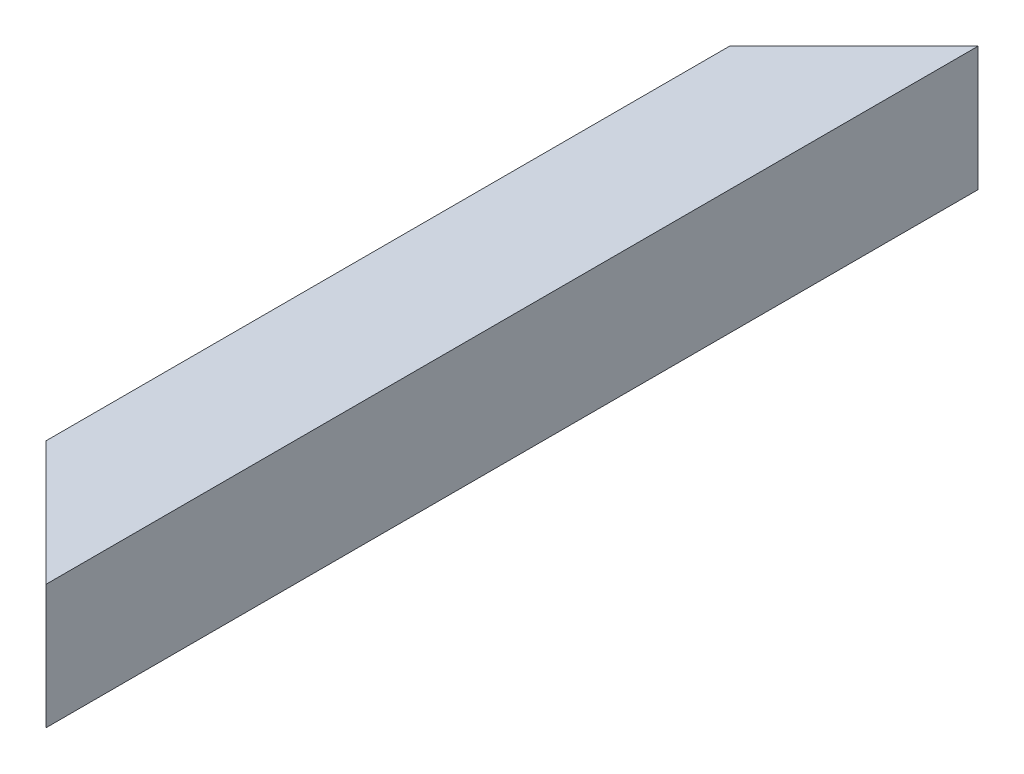
ISO-10303-21;
HEADER;
FILE_DESCRIPTION(('STEP AP214'),'2;1');
FILE_NAME('part.step','',(''),(''),'','','');
FILE_SCHEMA(('AUTOMOTIVE_DESIGN { 1 0 10303 214 1 1 1 1 }'));
ENDSEC;
DATA;
#1=APPLICATION_CONTEXT('core data for automotive mechanical design processes');
#2=APPLICATION_PROTOCOL_DEFINITION('international standard','automotive_design',2000,#1);
#3=PRODUCT_CONTEXT('',#1,'mechanical');
#4=PRODUCT('Part','Part','',(#3));
#5=PRODUCT_RELATED_PRODUCT_CATEGORY('part','',(#4));
#6=PRODUCT_DEFINITION_FORMATION('','',#4);
#7=PRODUCT_DEFINITION_CONTEXT('part definition',#1,'design');
#8=PRODUCT_DEFINITION('design','',#6,#7);
#9=PRODUCT_DEFINITION_SHAPE('','',#8);
#10=(LENGTH_UNIT() NAMED_UNIT(*) SI_UNIT(.MILLI.,.METRE.));
#11=(NAMED_UNIT(*) PLANE_ANGLE_UNIT() SI_UNIT($,.RADIAN.));
#12=(NAMED_UNIT(*) SI_UNIT($,.STERADIAN.) SOLID_ANGLE_UNIT());
#13=UNCERTAINTY_MEASURE_WITH_UNIT(LENGTH_MEASURE(1.E-05),#10,'distance_accuracy_value','');
#14=(GEOMETRIC_REPRESENTATION_CONTEXT(3) GLOBAL_UNCERTAINTY_ASSIGNED_CONTEXT((#13)) GLOBAL_UNIT_ASSIGNED_CONTEXT((#10,
#11,#12)) REPRESENTATION_CONTEXT('',''));
#15=CARTESIAN_POINT('',(0.,0.,0.));
#16=DIRECTION('',(0.,0.,1.));
#17=DIRECTION('',(1.,0.,0.));
#18=AXIS2_PLACEMENT_3D('',#15,#16,#17);
#19=CARTESIAN_POINT('',(-16.,16.,0.));
#20=DIRECTION('',(1.,0.,0.));
#21=DIRECTION('',(0.,0.,-1.));
#22=AXIS2_PLACEMENT_3D('',#19,#20,#21);
#23=PLANE('',#22);
#24=DIRECTION('',(0.,-1.,0.));
#25=VECTOR('',#24,1.);
#26=CARTESIAN_POINT('',(-16.,16.,35.9999999999996));
#27=LINE('',#26,#25);
#28=CARTESIAN_POINT('',(-16.,16.,35.9999999999996));
#29=VERTEX_POINT('',#28);
#30=CARTESIAN_POINT('',(-16.,-16.,35.9999999999996));
#31=VERTEX_POINT('',#30);
#32=EDGE_CURVE('E11',#29,#31,#27,.T.);
#33=ORIENTED_EDGE('',*,*,#32,.F.);
#34=DIRECTION('',(0.,0.,1.));
#35=VECTOR('',#34,1.);
#36=CARTESIAN_POINT('',(-16.,16.,0.));
#37=LINE('',#36,#35);
#38=CARTESIAN_POINT('',(-16.,16.,264.000000000001));
#39=VERTEX_POINT('',#38);
#40=EDGE_CURVE('E146',#29,#39,#37,.T.);
#41=ORIENTED_EDGE('',*,*,#40,.T.);
#42=DIRECTION('',(0.,1.,0.));
#43=VECTOR('',#42,1.);
#44=CARTESIAN_POINT('',(-16.,16.,264.000000000001));
#45=LINE('',#44,#43);
#46=CARTESIAN_POINT('',(-16.,-16.,264.000000000001));
#47=VERTEX_POINT('',#46);
#48=EDGE_CURVE('E44',#47,#39,#45,.T.);
#49=ORIENTED_EDGE('',*,*,#48,.F.);
#50=DIRECTION('',(0.,0.,1.));
#51=VECTOR('',#50,1.);
#52=CARTESIAN_POINT('',(-16.,-16.,0.));
#53=LINE('',#52,#51);
#54=EDGE_CURVE('E133',#31,#47,#53,.T.);
#55=ORIENTED_EDGE('',*,*,#54,.F.);
#56=EDGE_LOOP('',(#33,#41,#49,#55));
#57=FACE_BOUND('',#56,.T.);
#58=ADVANCED_FACE('F36',(#57),#23,.T.);
#59=CARTESIAN_POINT('',(-16.,-16.,0.));
#60=DIRECTION('',(0.,1.,0.));
#61=DIRECTION('',(0.,0.,1.));
#62=AXIS2_PLACEMENT_3D('',#59,#60,#61);
#63=PLANE('',#62);
#64=DIRECTION('',(0.707106781186551,0.,-0.707106781186544));
#65=VECTOR('',#64,1.);
#66=CARTESIAN_POINT('',(1.99999999999982,-16.,18.));
#67=LINE('',#66,#65);
#68=CARTESIAN_POINT('',(16.,-16.,3.99999999999997));
#69=VERTEX_POINT('',#68);
#70=EDGE_CURVE('E166',#31,#69,#67,.T.);
#71=ORIENTED_EDGE('',*,*,#70,.F.);
#72=ORIENTED_EDGE('',*,*,#54,.T.);
#73=DIRECTION('',(-0.707106781186552,0.,-0.707106781186543));
#74=VECTOR('',#73,1.);
#75=CARTESIAN_POINT('',(-148.,-16.,132.000000000002));
#76=LINE('',#75,#74);
#77=CARTESIAN_POINT('',(16.,-16.,296.));
#78=VERTEX_POINT('',#77);
#79=EDGE_CURVE('E58',#78,#47,#76,.T.);
#80=ORIENTED_EDGE('',*,*,#79,.F.);
#81=DIRECTION('',(0.,0.,1.));
#82=VECTOR('',#81,1.);
#83=CARTESIAN_POINT('',(16.,-16.,0.));
#84=LINE('',#83,#82);
#85=EDGE_CURVE('E136',#69,#78,#84,.T.);
#86=ORIENTED_EDGE('',*,*,#85,.F.);
#87=EDGE_LOOP('',(#71,#72,#80,#86));
#88=FACE_BOUND('',#87,.T.);
#89=ADVANCED_FACE('F182',(#88),#63,.T.);
#90=CARTESIAN_POINT('',(16.,16.,0.));
#91=DIRECTION('',(-1.,0.,0.));
#92=DIRECTION('',(0.,0.,1.));
#93=AXIS2_PLACEMENT_3D('',#90,#91,#92);
#94=PLANE('',#93);
#95=DIRECTION('',(0.,1.,0.));
#96=VECTOR('',#95,1.);
#97=CARTESIAN_POINT('',(16.,16.,3.99999999999997));
#98=LINE('',#97,#96);
#99=CARTESIAN_POINT('',(16.,16.,3.99999999999997));
#100=VERTEX_POINT('',#99);
#101=EDGE_CURVE('E168',#69,#100,#98,.T.);
#102=ORIENTED_EDGE('',*,*,#101,.F.);
#103=ORIENTED_EDGE('',*,*,#85,.T.);
#104=DIRECTION('',(0.,-1.,0.));
#105=VECTOR('',#104,1.);
#106=CARTESIAN_POINT('',(16.,16.,296.));
#107=LINE('',#106,#105);
#108=CARTESIAN_POINT('',(16.,16.,296.));
#109=VERTEX_POINT('',#108);
#110=EDGE_CURVE('E162',#109,#78,#107,.T.);
#111=ORIENTED_EDGE('',*,*,#110,.F.);
#112=DIRECTION('',(0.,0.,1.));
#113=VECTOR('',#112,1.);
#114=CARTESIAN_POINT('',(16.,16.,0.));
#115=LINE('',#114,#113);
#116=EDGE_CURVE('E142',#100,#109,#115,.T.);
#117=ORIENTED_EDGE('',*,*,#116,.F.);
#118=EDGE_LOOP('',(#102,#103,#111,#117));
#119=FACE_BOUND('',#118,.T.);
#120=ADVANCED_FACE('F179',(#119),#94,.T.);
#121=CARTESIAN_POINT('',(-16.,16.,0.));
#122=DIRECTION('',(0.,-1.,0.));
#123=DIRECTION('',(0.,0.,-1.));
#124=AXIS2_PLACEMENT_3D('',#121,#122,#123);
#125=PLANE('',#124);
#126=DIRECTION('',(-0.707106781186551,0.,0.707106781186544));
#127=VECTOR('',#126,1.);
#128=CARTESIAN_POINT('',(1.99999999999982,16.,18.));
#129=LINE('',#128,#127);
#130=EDGE_CURVE('E50',#100,#29,#129,.T.);
#131=ORIENTED_EDGE('',*,*,#130,.F.);
#132=ORIENTED_EDGE('',*,*,#116,.T.);
#133=DIRECTION('',(0.707106781186552,0.,0.707106781186543));
#134=VECTOR('',#133,1.);
#135=CARTESIAN_POINT('',(-148.,16.,132.000000000002));
#136=LINE('',#135,#134);
#137=EDGE_CURVE('E164',#39,#109,#136,.T.);
#138=ORIENTED_EDGE('',*,*,#137,.F.);
#139=ORIENTED_EDGE('',*,*,#40,.F.);
#140=EDGE_LOOP('',(#131,#132,#138,#139));
#141=FACE_BOUND('',#140,.T.);
#142=ADVANCED_FACE('F174',(#141),#125,.T.);
#143=CARTESIAN_POINT('',(20.,-20.,300.));
#144=DIRECTION('',(0.707106781186543,0.,-0.707106781186552));
#145=DIRECTION('',(-0.707106781186552,0.,-0.707106781186543));
#146=AXIS2_PLACEMENT_3D('',#143,#144,#145);
#147=PLANE('',#146);
#148=ORIENTED_EDGE('',*,*,#137,.T.);
#149=ORIENTED_EDGE('',*,*,#110,.T.);
#150=ORIENTED_EDGE('',*,*,#79,.T.);
#151=ORIENTED_EDGE('',*,*,#48,.T.);
#152=EDGE_LOOP('',(#148,#149,#150,#151));
#153=FACE_BOUND('',#152,.T.);
#154=DIRECTION('',(-0.707106781186552,0.,-0.707106781186543));
#155=VECTOR('',#154,1.);
#156=CARTESIAN_POINT('',(20.,20.,300.));
#157=LINE('',#156,#155);
#158=CARTESIAN_POINT('',(20.,20.,300.));
#159=VERTEX_POINT('',#158);
#160=CARTESIAN_POINT('',(-20.,20.,260.000000000001));
#161=VERTEX_POINT('',#160);
#162=EDGE_CURVE('E155',#159,#161,#157,.T.);
#163=ORIENTED_EDGE('',*,*,#162,.T.);
#164=DIRECTION('',(0.,1.,0.));
#165=VECTOR('',#164,1.);
#166=CARTESIAN_POINT('',(-20.,-20.,260.000000000001));
#167=LINE('',#166,#165);
#168=CARTESIAN_POINT('',(-20.,-20.,260.000000000001));
#169=VERTEX_POINT('',#168);
#170=EDGE_CURVE('E157',#169,#161,#167,.T.);
#171=ORIENTED_EDGE('',*,*,#170,.F.);
#172=DIRECTION('',(-0.707106781186552,0.,-0.707106781186543));
#173=VECTOR('',#172,1.);
#174=CARTESIAN_POINT('',(20.,-20.,300.));
#175=LINE('',#174,#173);
#176=CARTESIAN_POINT('',(20.,-20.,300.));
#177=VERTEX_POINT('',#176);
#178=EDGE_CURVE('E123',#177,#169,#175,.T.);
#179=ORIENTED_EDGE('',*,*,#178,.F.);
#180=DIRECTION('',(0.,1.,0.));
#181=VECTOR('',#180,1.);
#182=CARTESIAN_POINT('',(20.,20.,300.));
#183=LINE('',#182,#181);
#184=EDGE_CURVE('E145',#177,#159,#183,.T.);
#185=ORIENTED_EDGE('',*,*,#184,.T.);
#186=EDGE_LOOP('',(#163,#171,#179,#185));
#187=FACE_BOUND('',#186,.T.);
#188=ADVANCED_FACE('F181',(#153,#187),#147,.F.);
#189=CARTESIAN_POINT('',(20.,-20.,0.));
#190=DIRECTION('',(0.707106781186544,0.,0.707106781186551));
#191=DIRECTION('',(0.707106781186551,0.,-0.707106781186544));
#192=AXIS2_PLACEMENT_3D('',#189,#190,#191);
#193=PLANE('',#192);
#194=ORIENTED_EDGE('',*,*,#130,.T.);
#195=ORIENTED_EDGE('',*,*,#32,.T.);
#196=ORIENTED_EDGE('',*,*,#70,.T.);
#197=ORIENTED_EDGE('',*,*,#101,.T.);
#198=EDGE_LOOP('',(#194,#195,#196,#197));
#199=FACE_BOUND('',#198,.T.);
#200=DIRECTION('',(0.707106781186551,0.,-0.707106781186544));
#201=VECTOR('',#200,1.);
#202=CARTESIAN_POINT('',(20.,20.,0.));
#203=LINE('',#202,#201);
#204=CARTESIAN_POINT('',(-20.,20.,39.9999999999996));
#205=VERTEX_POINT('',#204);
#206=CARTESIAN_POINT('',(20.,20.,0.));
#207=VERTEX_POINT('',#206);
#208=EDGE_CURVE('E110',#205,#207,#203,.T.);
#209=ORIENTED_EDGE('',*,*,#208,.T.);
#210=DIRECTION('',(0.,1.,0.));
#211=VECTOR('',#210,1.);
#212=CARTESIAN_POINT('',(20.,20.,0.));
#213=LINE('',#212,#211);
#214=CARTESIAN_POINT('',(20.,-20.,0.));
#215=VERTEX_POINT('',#214);
#216=EDGE_CURVE('E105',#215,#207,#213,.T.);
#217=ORIENTED_EDGE('',*,*,#216,.F.);
#218=DIRECTION('',(0.707106781186551,0.,-0.707106781186544));
#219=VECTOR('',#218,1.);
#220=CARTESIAN_POINT('',(20.,-20.,0.));
#221=LINE('',#220,#219);
#222=CARTESIAN_POINT('',(-20.,-20.,39.9999999999996));
#223=VERTEX_POINT('',#222);
#224=EDGE_CURVE('E99',#223,#215,#221,.T.);
#225=ORIENTED_EDGE('',*,*,#224,.F.);
#226=DIRECTION('',(0.,1.,0.));
#227=VECTOR('',#226,1.);
#228=CARTESIAN_POINT('',(-20.,-20.,39.9999999999996));
#229=LINE('',#228,#227);
#230=EDGE_CURVE('E102',#223,#205,#229,.T.);
#231=ORIENTED_EDGE('',*,*,#230,.T.);
#232=EDGE_LOOP('',(#209,#217,#225,#231));
#233=FACE_BOUND('',#232,.T.);
#234=ADVANCED_FACE('F101',(#199,#233),#193,.F.);
#235=CARTESIAN_POINT('',(-20.,20.,0.));
#236=DIRECTION('',(-1.,0.,0.));
#237=DIRECTION('',(0.,0.,1.));
#238=AXIS2_PLACEMENT_3D('',#235,#236,#237);
#239=PLANE('',#238);
#240=ORIENTED_EDGE('',*,*,#230,.F.);
#241=DIRECTION('',(0.,0.,1.));
#242=VECTOR('',#241,1.);
#243=CARTESIAN_POINT('',(-20.,-20.,0.));
#244=LINE('',#243,#242);
#245=EDGE_CURVE('E117',#223,#169,#244,.T.);
#246=ORIENTED_EDGE('',*,*,#245,.T.);
#247=ORIENTED_EDGE('',*,*,#170,.T.);
#248=DIRECTION('',(0.,0.,1.));
#249=VECTOR('',#248,1.);
#250=CARTESIAN_POINT('',(-20.,20.,0.));
#251=LINE('',#250,#249);
#252=EDGE_CURVE('E119',#205,#161,#251,.T.);
#253=ORIENTED_EDGE('',*,*,#252,.F.);
#254=EDGE_LOOP('',(#240,#246,#247,#253));
#255=FACE_BOUND('',#254,.T.);
#256=ADVANCED_FACE('F115',(#255),#239,.T.);
#257=CARTESIAN_POINT('',(-20.,-20.,0.));
#258=DIRECTION('',(0.,-1.,0.));
#259=DIRECTION('',(0.,0.,-1.));
#260=AXIS2_PLACEMENT_3D('',#257,#258,#259);
#261=PLANE('',#260);
#262=ORIENTED_EDGE('',*,*,#224,.T.);
#263=DIRECTION('',(0.,0.,1.));
#264=VECTOR('',#263,1.);
#265=CARTESIAN_POINT('',(20.,-20.,0.));
#266=LINE('',#265,#264);
#267=EDGE_CURVE('E124',#215,#177,#266,.T.);
#268=ORIENTED_EDGE('',*,*,#267,.T.);
#269=ORIENTED_EDGE('',*,*,#178,.T.);
#270=ORIENTED_EDGE('',*,*,#245,.F.);
#271=EDGE_LOOP('',(#262,#268,#269,#270));
#272=FACE_BOUND('',#271,.T.);
#273=ADVANCED_FACE('F122',(#272),#261,.T.);
#274=CARTESIAN_POINT('',(20.,20.,0.));
#275=DIRECTION('',(1.,0.,0.));
#276=DIRECTION('',(0.,0.,-1.));
#277=AXIS2_PLACEMENT_3D('',#274,#275,#276);
#278=PLANE('',#277);
#279=DIRECTION('',(0.,0.,1.));
#280=VECTOR('',#279,1.);
#281=CARTESIAN_POINT('',(20.,20.,0.));
#282=LINE('',#281,#280);
#283=EDGE_CURVE('E126',#207,#159,#282,.T.);
#284=ORIENTED_EDGE('',*,*,#283,.T.);
#285=ORIENTED_EDGE('',*,*,#184,.F.);
#286=ORIENTED_EDGE('',*,*,#267,.F.);
#287=ORIENTED_EDGE('',*,*,#216,.T.);
#288=EDGE_LOOP('',(#284,#285,#286,#287));
#289=FACE_BOUND('',#288,.T.);
#290=ADVANCED_FACE('F153',(#289),#278,.T.);
#291=CARTESIAN_POINT('',(-20.,20.,0.));
#292=DIRECTION('',(0.,1.,0.));
#293=DIRECTION('',(0.,0.,1.));
#294=AXIS2_PLACEMENT_3D('',#291,#292,#293);
#295=PLANE('',#294);
#296=ORIENTED_EDGE('',*,*,#208,.F.);
#297=ORIENTED_EDGE('',*,*,#252,.T.);
#298=ORIENTED_EDGE('',*,*,#162,.F.);
#299=ORIENTED_EDGE('',*,*,#283,.F.);
#300=EDGE_LOOP('',(#296,#297,#298,#299));
#301=FACE_BOUND('',#300,.T.);
#302=ADVANCED_FACE('F38',(#301),#295,.T.);
#303=CLOSED_SHELL('',(#58,#89,#120,#142,#188,#234,#256,#273,#290,#302));
#304=MANIFOLD_SOLID_BREP('B2',#303);
#305=ADVANCED_BREP_SHAPE_REPRESENTATION('',(#18,#304),#14);
#306=SHAPE_DEFINITION_REPRESENTATION(#9,#305);
ENDSEC;
END-ISO-10303-21;
